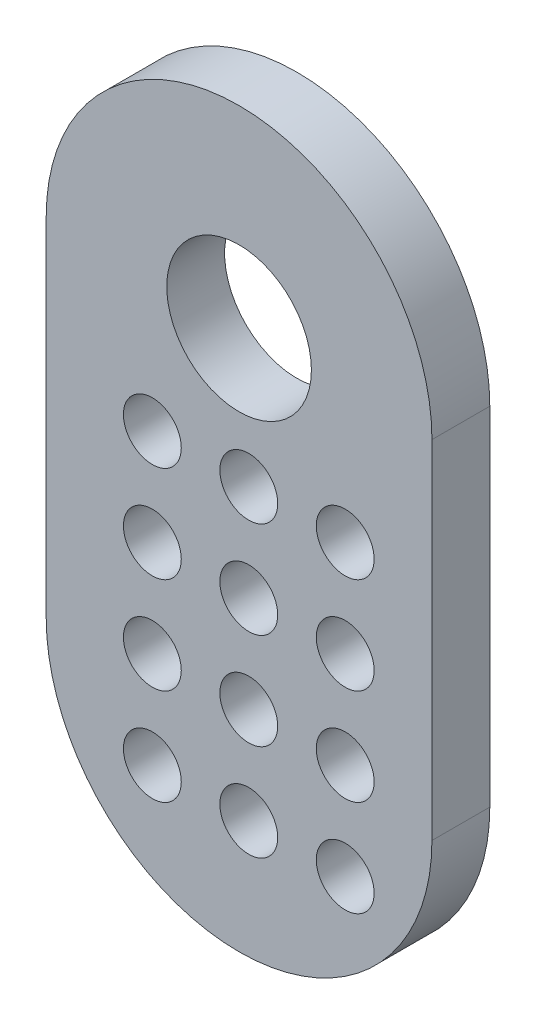
ISO-10303-21;
HEADER;
FILE_DESCRIPTION(('STEP AP214'),'2;1');
FILE_NAME('part.step','',(''),(''),'','','');
FILE_SCHEMA(('AUTOMOTIVE_DESIGN { 1 0 10303 214 1 1 1 1 }'));
ENDSEC;
DATA;
#1=APPLICATION_CONTEXT('core data for automotive mechanical design processes');
#2=APPLICATION_PROTOCOL_DEFINITION('international standard','automotive_design',2000,#1);
#3=PRODUCT_CONTEXT('',#1,'mechanical');
#4=PRODUCT('Part','Part','',(#3));
#5=PRODUCT_RELATED_PRODUCT_CATEGORY('part','',(#4));
#6=PRODUCT_DEFINITION_FORMATION('','',#4);
#7=PRODUCT_DEFINITION_CONTEXT('part definition',#1,'design');
#8=PRODUCT_DEFINITION('design','',#6,#7);
#9=PRODUCT_DEFINITION_SHAPE('','',#8);
#10=(LENGTH_UNIT() NAMED_UNIT(*) SI_UNIT(.MILLI.,.METRE.));
#11=(NAMED_UNIT(*) PLANE_ANGLE_UNIT() SI_UNIT($,.RADIAN.));
#12=(NAMED_UNIT(*) SI_UNIT($,.STERADIAN.) SOLID_ANGLE_UNIT());
#13=UNCERTAINTY_MEASURE_WITH_UNIT(LENGTH_MEASURE(1.E-05),#10,'distance_accuracy_value','');
#14=(GEOMETRIC_REPRESENTATION_CONTEXT(3) GLOBAL_UNCERTAINTY_ASSIGNED_CONTEXT((#13)) GLOBAL_UNIT_ASSIGNED_CONTEXT((#10,
#11,#12)) REPRESENTATION_CONTEXT('',''));
#15=CARTESIAN_POINT('',(0.,0.,0.));
#16=DIRECTION('',(0.,0.,1.));
#17=DIRECTION('',(1.,0.,0.));
#18=AXIS2_PLACEMENT_3D('',#15,#16,#17);
#19=CARTESIAN_POINT('',(-10.,0.,3.));
#20=DIRECTION('',(-1.,0.,0.));
#21=DIRECTION('',(0.,-1.,0.));
#22=AXIS2_PLACEMENT_3D('',#19,#20,#21);
#23=PLANE('',#22);
#24=DIRECTION('',(0.,1.,0.));
#25=VECTOR('',#24,1.);
#26=CARTESIAN_POINT('',(-10.,0.,0.));
#27=LINE('',#26,#25);
#28=CARTESIAN_POINT('',(-10.,-18.,0.));
#29=VERTEX_POINT('',#28);
#30=CARTESIAN_POINT('',(-10.,0.,0.));
#31=VERTEX_POINT('',#30);
#32=EDGE_CURVE('E121',#29,#31,#27,.T.);
#33=ORIENTED_EDGE('',*,*,#32,.F.);
#34=DIRECTION('',(0.,0.,-1.));
#35=VECTOR('',#34,1.);
#36=CARTESIAN_POINT('',(-10.,-18.,3.));
#37=LINE('',#36,#35);
#38=CARTESIAN_POINT('',(-10.,-18.,3.));
#39=VERTEX_POINT('',#38);
#40=EDGE_CURVE('E11',#39,#29,#37,.T.);
#41=ORIENTED_EDGE('',*,*,#40,.F.);
#42=DIRECTION('',(0.,1.,0.));
#43=VECTOR('',#42,1.);
#44=CARTESIAN_POINT('',(-10.,0.,3.));
#45=LINE('',#44,#43);
#46=CARTESIAN_POINT('',(-10.,0.,3.));
#47=VERTEX_POINT('',#46);
#48=EDGE_CURVE('E98',#39,#47,#45,.T.);
#49=ORIENTED_EDGE('',*,*,#48,.T.);
#50=DIRECTION('',(0.,0.,-1.));
#51=VECTOR('',#50,1.);
#52=CARTESIAN_POINT('',(-10.,0.,3.));
#53=LINE('',#52,#51);
#54=EDGE_CURVE('E59',#47,#31,#53,.T.);
#55=ORIENTED_EDGE('',*,*,#54,.T.);
#56=EDGE_LOOP('',(#33,#41,#49,#55));
#57=FACE_BOUND('',#56,.T.);
#58=ADVANCED_FACE('F41',(#57),#23,.T.);
#59=CARTESIAN_POINT('',(0.,-18.,3.));
#60=DIRECTION('',(0.,0.,-1.));
#61=DIRECTION('',(-1.,0.,0.));
#62=AXIS2_PLACEMENT_3D('',#59,#60,#61);
#63=CYLINDRICAL_SURFACE('',#62,10.);
#64=CARTESIAN_POINT('',(0.,-18.,0.));
#65=DIRECTION('',(0.,0.,1.));
#66=DIRECTION('',(1.,0.,0.));
#67=AXIS2_PLACEMENT_3D('',#64,#65,#66);
#68=CIRCLE('',#67,10.);
#69=CARTESIAN_POINT('',(10.,-18.,0.));
#70=VERTEX_POINT('',#69);
#71=EDGE_CURVE('E104',#29,#70,#68,.T.);
#72=ORIENTED_EDGE('',*,*,#71,.T.);
#73=DIRECTION('',(0.,0.,-1.));
#74=VECTOR('',#73,1.);
#75=CARTESIAN_POINT('',(10.,-18.,3.));
#76=LINE('',#75,#74);
#77=CARTESIAN_POINT('',(10.,-18.,3.));
#78=VERTEX_POINT('',#77);
#79=EDGE_CURVE('E51',#78,#70,#76,.T.);
#80=ORIENTED_EDGE('',*,*,#79,.F.);
#81=CARTESIAN_POINT('',(0.,-18.,3.));
#82=DIRECTION('',(0.,0.,1.));
#83=DIRECTION('',(1.,0.,0.));
#84=AXIS2_PLACEMENT_3D('',#81,#82,#83);
#85=CIRCLE('',#84,10.);
#86=EDGE_CURVE('E94',#39,#78,#85,.T.);
#87=ORIENTED_EDGE('',*,*,#86,.F.);
#88=ORIENTED_EDGE('',*,*,#40,.T.);
#89=EDGE_LOOP('',(#72,#80,#87,#88));
#90=FACE_BOUND('',#89,.T.);
#91=ADVANCED_FACE('F102',(#90),#63,.T.);
#92=CARTESIAN_POINT('',(10.,0.,3.));
#93=DIRECTION('',(-1.,0.,0.));
#94=DIRECTION('',(0.,0.,1.));
#95=AXIS2_PLACEMENT_3D('',#92,#93,#94);
#96=PLANE('',#95);
#97=DIRECTION('',(0.,1.,0.));
#98=VECTOR('',#97,1.);
#99=CARTESIAN_POINT('',(10.,0.,0.));
#100=LINE('',#99,#98);
#101=CARTESIAN_POINT('',(10.,0.,0.));
#102=VERTEX_POINT('',#101);
#103=EDGE_CURVE('E116',#70,#102,#100,.T.);
#104=ORIENTED_EDGE('',*,*,#103,.T.);
#105=DIRECTION('',(0.,0.,-1.));
#106=VECTOR('',#105,1.);
#107=CARTESIAN_POINT('',(10.,0.,3.));
#108=LINE('',#107,#106);
#109=CARTESIAN_POINT('',(10.,0.,3.));
#110=VERTEX_POINT('',#109);
#111=EDGE_CURVE('E73',#110,#102,#108,.T.);
#112=ORIENTED_EDGE('',*,*,#111,.F.);
#113=DIRECTION('',(0.,1.,0.));
#114=VECTOR('',#113,1.);
#115=CARTESIAN_POINT('',(10.,0.,3.));
#116=LINE('',#115,#114);
#117=EDGE_CURVE('E85',#78,#110,#116,.T.);
#118=ORIENTED_EDGE('',*,*,#117,.F.);
#119=ORIENTED_EDGE('',*,*,#79,.T.);
#120=EDGE_LOOP('',(#104,#112,#118,#119));
#121=FACE_BOUND('',#120,.T.);
#122=ADVANCED_FACE('F87',(#121),#96,.F.);
#123=CARTESIAN_POINT('',(-4.49661447687407,-6.86721952929556,3.));
#124=DIRECTION('',(0.,0.,-1.));
#125=DIRECTION('',(-1.,0.,0.));
#126=AXIS2_PLACEMENT_3D('',#123,#124,#125);
#127=CYLINDRICAL_SURFACE('',#126,1.5);
#128=CARTESIAN_POINT('',(-4.49661447687407,-6.86721952929556,3.));
#129=DIRECTION('',(0.,0.,1.));
#130=DIRECTION('',(1.,0.,0.));
#131=AXIS2_PLACEMENT_3D('',#128,#129,#130);
#132=CIRCLE('',#131,1.5);
#133=CARTESIAN_POINT('',(-2.99661447687407,-6.86721952929556,3.));
#134=VERTEX_POINT('',#133);
#135=EDGE_CURVE('E180',#134,#134,#132,.T.);
#136=ORIENTED_EDGE('',*,*,#135,.T.);
#137=EDGE_LOOP('',(#136));
#138=FACE_BOUND('',#137,.T.);
#139=CARTESIAN_POINT('',(-4.49661447687407,-6.86721952929556,0.));
#140=DIRECTION('',(0.,0.,1.));
#141=DIRECTION('',(1.,0.,0.));
#142=AXIS2_PLACEMENT_3D('',#139,#140,#141);
#143=CIRCLE('',#142,1.5);
#144=CARTESIAN_POINT('',(-2.99661447687407,-6.86721952929556,0.));
#145=VERTEX_POINT('',#144);
#146=EDGE_CURVE('E124',#145,#145,#143,.T.);
#147=ORIENTED_EDGE('',*,*,#146,.F.);
#148=EDGE_LOOP('',(#147));
#149=FACE_BOUND('',#148,.T.);
#150=ADVANCED_FACE('F263',(#138,#149),#127,.F.);
#151=CARTESIAN_POINT('',(-4.49661447687405,-11.8672195292956,3.));
#152=DIRECTION('',(0.,0.,-1.));
#153=DIRECTION('',(-1.,0.,0.));
#154=AXIS2_PLACEMENT_3D('',#151,#152,#153);
#155=CYLINDRICAL_SURFACE('',#154,1.5);
#156=CARTESIAN_POINT('',(-4.49661447687405,-11.8672195292956,3.));
#157=DIRECTION('',(0.,0.,1.));
#158=DIRECTION('',(1.,0.,0.));
#159=AXIS2_PLACEMENT_3D('',#156,#157,#158);
#160=CIRCLE('',#159,1.5);
#161=CARTESIAN_POINT('',(-2.99661447687405,-11.8672195292956,3.));
#162=VERTEX_POINT('',#161);
#163=EDGE_CURVE('E184',#162,#162,#160,.T.);
#164=ORIENTED_EDGE('',*,*,#163,.T.);
#165=EDGE_LOOP('',(#164));
#166=FACE_BOUND('',#165,.T.);
#167=CARTESIAN_POINT('',(-4.49661447687405,-11.8672195292956,0.));
#168=DIRECTION('',(0.,0.,1.));
#169=DIRECTION('',(1.,0.,0.));
#170=AXIS2_PLACEMENT_3D('',#167,#168,#169);
#171=CIRCLE('',#170,1.5);
#172=CARTESIAN_POINT('',(-2.99661447687405,-11.8672195292956,0.));
#173=VERTEX_POINT('',#172);
#174=EDGE_CURVE('E128',#173,#173,#171,.T.);
#175=ORIENTED_EDGE('',*,*,#174,.F.);
#176=EDGE_LOOP('',(#175));
#177=FACE_BOUND('',#176,.T.);
#178=ADVANCED_FACE('F266',(#166,#177),#155,.F.);
#179=CARTESIAN_POINT('',(-4.49661447687403,-16.8672195292956,3.));
#180=DIRECTION('',(0.,0.,-1.));
#181=DIRECTION('',(-1.,0.,0.));
#182=AXIS2_PLACEMENT_3D('',#179,#180,#181);
#183=CYLINDRICAL_SURFACE('',#182,1.5);
#184=CARTESIAN_POINT('',(-4.49661447687403,-16.8672195292956,3.));
#185=DIRECTION('',(0.,0.,1.));
#186=DIRECTION('',(1.,0.,0.));
#187=AXIS2_PLACEMENT_3D('',#184,#185,#186);
#188=CIRCLE('',#187,1.5);
#189=CARTESIAN_POINT('',(-2.99661447687403,-16.8672195292956,3.));
#190=VERTEX_POINT('',#189);
#191=EDGE_CURVE('E188',#190,#190,#188,.T.);
#192=ORIENTED_EDGE('',*,*,#191,.T.);
#193=EDGE_LOOP('',(#192));
#194=FACE_BOUND('',#193,.T.);
#195=CARTESIAN_POINT('',(-4.49661447687403,-16.8672195292956,0.));
#196=DIRECTION('',(0.,0.,1.));
#197=DIRECTION('',(1.,0.,0.));
#198=AXIS2_PLACEMENT_3D('',#195,#196,#197);
#199=CIRCLE('',#198,1.5);
#200=CARTESIAN_POINT('',(-2.99661447687403,-16.8672195292956,0.));
#201=VERTEX_POINT('',#200);
#202=EDGE_CURVE('E132',#201,#201,#199,.T.);
#203=ORIENTED_EDGE('',*,*,#202,.F.);
#204=EDGE_LOOP('',(#203));
#205=FACE_BOUND('',#204,.T.);
#206=ADVANCED_FACE('F290',(#194,#205),#183,.F.);
#207=CARTESIAN_POINT('',(5.50338552312593,-6.86721952929556,3.));
#208=DIRECTION('',(0.,0.,-1.));
#209=DIRECTION('',(-1.,0.,0.));
#210=AXIS2_PLACEMENT_3D('',#207,#208,#209);
#211=CYLINDRICAL_SURFACE('',#210,1.5);
#212=CARTESIAN_POINT('',(5.50338552312593,-6.86721952929556,3.));
#213=DIRECTION('',(0.,0.,1.));
#214=DIRECTION('',(1.,0.,0.));
#215=AXIS2_PLACEMENT_3D('',#212,#213,#214);
#216=CIRCLE('',#215,1.5);
#217=CARTESIAN_POINT('',(7.00338552312593,-6.86721952929556,3.));
#218=VERTEX_POINT('',#217);
#219=EDGE_CURVE('E192',#218,#218,#216,.T.);
#220=ORIENTED_EDGE('',*,*,#219,.T.);
#221=EDGE_LOOP('',(#220));
#222=FACE_BOUND('',#221,.T.);
#223=CARTESIAN_POINT('',(5.50338552312593,-6.86721952929556,0.));
#224=DIRECTION('',(0.,0.,1.));
#225=DIRECTION('',(1.,0.,0.));
#226=AXIS2_PLACEMENT_3D('',#223,#224,#225);
#227=CIRCLE('',#226,1.5);
#228=CARTESIAN_POINT('',(7.00338552312593,-6.86721952929556,0.));
#229=VERTEX_POINT('',#228);
#230=EDGE_CURVE('E136',#229,#229,#227,.T.);
#231=ORIENTED_EDGE('',*,*,#230,.F.);
#232=EDGE_LOOP('',(#231));
#233=FACE_BOUND('',#232,.T.);
#234=ADVANCED_FACE('F294',(#222,#233),#211,.F.);
#235=CARTESIAN_POINT('',(0.503385523125932,-6.86721952929556,3.));
#236=DIRECTION('',(0.,0.,-1.));
#237=DIRECTION('',(-1.,0.,0.));
#238=AXIS2_PLACEMENT_3D('',#235,#236,#237);
#239=CYLINDRICAL_SURFACE('',#238,1.5);
#240=CARTESIAN_POINT('',(0.503385523125932,-6.86721952929556,3.));
#241=DIRECTION('',(0.,0.,1.));
#242=DIRECTION('',(1.,0.,0.));
#243=AXIS2_PLACEMENT_3D('',#240,#241,#242);
#244=CIRCLE('',#243,1.5);
#245=CARTESIAN_POINT('',(2.00338552312593,-6.86721952929556,3.));
#246=VERTEX_POINT('',#245);
#247=EDGE_CURVE('E196',#246,#246,#244,.T.);
#248=ORIENTED_EDGE('',*,*,#247,.T.);
#249=EDGE_LOOP('',(#248));
#250=FACE_BOUND('',#249,.T.);
#251=CARTESIAN_POINT('',(0.503385523125932,-6.86721952929556,0.));
#252=DIRECTION('',(0.,0.,1.));
#253=DIRECTION('',(1.,0.,0.));
#254=AXIS2_PLACEMENT_3D('',#251,#252,#253);
#255=CIRCLE('',#254,1.5);
#256=CARTESIAN_POINT('',(2.00338552312593,-6.86721952929556,0.));
#257=VERTEX_POINT('',#256);
#258=EDGE_CURVE('E140',#257,#257,#255,.T.);
#259=ORIENTED_EDGE('',*,*,#258,.F.);
#260=EDGE_LOOP('',(#259));
#261=FACE_BOUND('',#260,.T.);
#262=ADVANCED_FACE('F298',(#250,#261),#239,.F.);
#263=CARTESIAN_POINT('',(5.50338552312595,-11.8672195292956,3.));
#264=DIRECTION('',(0.,0.,-1.));
#265=DIRECTION('',(-1.,0.,0.));
#266=AXIS2_PLACEMENT_3D('',#263,#264,#265);
#267=CYLINDRICAL_SURFACE('',#266,1.5);
#268=CARTESIAN_POINT('',(5.50338552312595,-11.8672195292956,3.));
#269=DIRECTION('',(0.,0.,1.));
#270=DIRECTION('',(1.,0.,0.));
#271=AXIS2_PLACEMENT_3D('',#268,#269,#270);
#272=CIRCLE('',#271,1.5);
#273=CARTESIAN_POINT('',(7.00338552312595,-11.8672195292956,3.));
#274=VERTEX_POINT('',#273);
#275=EDGE_CURVE('E200',#274,#274,#272,.T.);
#276=ORIENTED_EDGE('',*,*,#275,.T.);
#277=EDGE_LOOP('',(#276));
#278=FACE_BOUND('',#277,.T.);
#279=CARTESIAN_POINT('',(5.50338552312595,-11.8672195292956,0.));
#280=DIRECTION('',(0.,0.,1.));
#281=DIRECTION('',(1.,0.,0.));
#282=AXIS2_PLACEMENT_3D('',#279,#280,#281);
#283=CIRCLE('',#282,1.5);
#284=CARTESIAN_POINT('',(7.00338552312595,-11.8672195292956,0.));
#285=VERTEX_POINT('',#284);
#286=EDGE_CURVE('E144',#285,#285,#283,.T.);
#287=ORIENTED_EDGE('',*,*,#286,.F.);
#288=EDGE_LOOP('',(#287));
#289=FACE_BOUND('',#288,.T.);
#290=ADVANCED_FACE('F302',(#278,#289),#267,.F.);
#291=CARTESIAN_POINT('',(0.503385523125949,-11.8672195292956,3.));
#292=DIRECTION('',(0.,0.,-1.));
#293=DIRECTION('',(-1.,0.,0.));
#294=AXIS2_PLACEMENT_3D('',#291,#292,#293);
#295=CYLINDRICAL_SURFACE('',#294,1.5);
#296=CARTESIAN_POINT('',(0.503385523125949,-11.8672195292956,3.));
#297=DIRECTION('',(0.,0.,1.));
#298=DIRECTION('',(1.,0.,0.));
#299=AXIS2_PLACEMENT_3D('',#296,#297,#298);
#300=CIRCLE('',#299,1.5);
#301=CARTESIAN_POINT('',(2.00338552312595,-11.8672195292956,3.));
#302=VERTEX_POINT('',#301);
#303=EDGE_CURVE('E204',#302,#302,#300,.T.);
#304=ORIENTED_EDGE('',*,*,#303,.T.);
#305=EDGE_LOOP('',(#304));
#306=FACE_BOUND('',#305,.T.);
#307=CARTESIAN_POINT('',(0.503385523125949,-11.8672195292956,0.));
#308=DIRECTION('',(0.,0.,1.));
#309=DIRECTION('',(1.,0.,0.));
#310=AXIS2_PLACEMENT_3D('',#307,#308,#309);
#311=CIRCLE('',#310,1.5);
#312=CARTESIAN_POINT('',(2.00338552312595,-11.8672195292956,0.));
#313=VERTEX_POINT('',#312);
#314=EDGE_CURVE('E148',#313,#313,#311,.T.);
#315=ORIENTED_EDGE('',*,*,#314,.F.);
#316=EDGE_LOOP('',(#315));
#317=FACE_BOUND('',#316,.T.);
#318=ADVANCED_FACE('F306',(#306,#317),#295,.F.);
#319=CARTESIAN_POINT('',(5.50338552312597,-16.8672195292956,3.));
#320=DIRECTION('',(0.,0.,-1.));
#321=DIRECTION('',(-1.,0.,0.));
#322=AXIS2_PLACEMENT_3D('',#319,#320,#321);
#323=CYLINDRICAL_SURFACE('',#322,1.5);
#324=CARTESIAN_POINT('',(5.50338552312597,-16.8672195292956,3.));
#325=DIRECTION('',(0.,0.,1.));
#326=DIRECTION('',(1.,0.,0.));
#327=AXIS2_PLACEMENT_3D('',#324,#325,#326);
#328=CIRCLE('',#327,1.5);
#329=CARTESIAN_POINT('',(7.00338552312597,-16.8672195292956,3.));
#330=VERTEX_POINT('',#329);
#331=EDGE_CURVE('E208',#330,#330,#328,.T.);
#332=ORIENTED_EDGE('',*,*,#331,.T.);
#333=EDGE_LOOP('',(#332));
#334=FACE_BOUND('',#333,.T.);
#335=CARTESIAN_POINT('',(5.50338552312597,-16.8672195292956,0.));
#336=DIRECTION('',(0.,0.,1.));
#337=DIRECTION('',(1.,0.,0.));
#338=AXIS2_PLACEMENT_3D('',#335,#336,#337);
#339=CIRCLE('',#338,1.5);
#340=CARTESIAN_POINT('',(7.00338552312597,-16.8672195292956,0.));
#341=VERTEX_POINT('',#340);
#342=EDGE_CURVE('E152',#341,#341,#339,.T.);
#343=ORIENTED_EDGE('',*,*,#342,.F.);
#344=EDGE_LOOP('',(#343));
#345=FACE_BOUND('',#344,.T.);
#346=ADVANCED_FACE('F310',(#334,#345),#323,.F.);
#347=CARTESIAN_POINT('',(0.503385523125966,-16.8672195292956,3.));
#348=DIRECTION('',(0.,0.,-1.));
#349=DIRECTION('',(-1.,0.,0.));
#350=AXIS2_PLACEMENT_3D('',#347,#348,#349);
#351=CYLINDRICAL_SURFACE('',#350,1.5);
#352=CARTESIAN_POINT('',(0.503385523125966,-16.8672195292956,3.));
#353=DIRECTION('',(0.,0.,1.));
#354=DIRECTION('',(1.,0.,0.));
#355=AXIS2_PLACEMENT_3D('',#352,#353,#354);
#356=CIRCLE('',#355,1.5);
#357=CARTESIAN_POINT('',(2.00338552312597,-16.8672195292956,3.));
#358=VERTEX_POINT('',#357);
#359=EDGE_CURVE('E212',#358,#358,#356,.T.);
#360=ORIENTED_EDGE('',*,*,#359,.T.);
#361=EDGE_LOOP('',(#360));
#362=FACE_BOUND('',#361,.T.);
#363=CARTESIAN_POINT('',(0.503385523125966,-16.8672195292956,0.));
#364=DIRECTION('',(0.,0.,1.));
#365=DIRECTION('',(1.,0.,0.));
#366=AXIS2_PLACEMENT_3D('',#363,#364,#365);
#367=CIRCLE('',#366,1.5);
#368=CARTESIAN_POINT('',(2.00338552312597,-16.8672195292956,0.));
#369=VERTEX_POINT('',#368);
#370=EDGE_CURVE('E156',#369,#369,#367,.T.);
#371=ORIENTED_EDGE('',*,*,#370,.F.);
#372=EDGE_LOOP('',(#371));
#373=FACE_BOUND('',#372,.T.);
#374=ADVANCED_FACE('F314',(#362,#373),#351,.F.);
#375=CARTESIAN_POINT('',(5.50338552312598,-21.8672195292956,3.));
#376=DIRECTION('',(0.,0.,-1.));
#377=DIRECTION('',(-1.,0.,0.));
#378=AXIS2_PLACEMENT_3D('',#375,#376,#377);
#379=CYLINDRICAL_SURFACE('',#378,1.5);
#380=CARTESIAN_POINT('',(5.50338552312598,-21.8672195292956,3.));
#381=DIRECTION('',(0.,0.,1.));
#382=DIRECTION('',(1.,0.,0.));
#383=AXIS2_PLACEMENT_3D('',#380,#381,#382);
#384=CIRCLE('',#383,1.5);
#385=CARTESIAN_POINT('',(7.00338552312598,-21.8672195292956,3.));
#386=VERTEX_POINT('',#385);
#387=EDGE_CURVE('E216',#386,#386,#384,.T.);
#388=ORIENTED_EDGE('',*,*,#387,.T.);
#389=EDGE_LOOP('',(#388));
#390=FACE_BOUND('',#389,.T.);
#391=CARTESIAN_POINT('',(5.50338552312598,-21.8672195292956,0.));
#392=DIRECTION('',(0.,0.,1.));
#393=DIRECTION('',(1.,0.,0.));
#394=AXIS2_PLACEMENT_3D('',#391,#392,#393);
#395=CIRCLE('',#394,1.5);
#396=CARTESIAN_POINT('',(7.00338552312598,-21.8672195292956,0.));
#397=VERTEX_POINT('',#396);
#398=EDGE_CURVE('E160',#397,#397,#395,.T.);
#399=ORIENTED_EDGE('',*,*,#398,.F.);
#400=EDGE_LOOP('',(#399));
#401=FACE_BOUND('',#400,.T.);
#402=ADVANCED_FACE('F318',(#390,#401),#379,.F.);
#403=CARTESIAN_POINT('',(0.503385523125984,-21.8672195292956,3.));
#404=DIRECTION('',(0.,0.,-1.));
#405=DIRECTION('',(-1.,0.,0.));
#406=AXIS2_PLACEMENT_3D('',#403,#404,#405);
#407=CYLINDRICAL_SURFACE('',#406,1.5);
#408=CARTESIAN_POINT('',(0.503385523125984,-21.8672195292956,3.));
#409=DIRECTION('',(0.,0.,1.));
#410=DIRECTION('',(1.,0.,0.));
#411=AXIS2_PLACEMENT_3D('',#408,#409,#410);
#412=CIRCLE('',#411,1.5);
#413=CARTESIAN_POINT('',(2.00338552312598,-21.8672195292956,3.));
#414=VERTEX_POINT('',#413);
#415=EDGE_CURVE('E220',#414,#414,#412,.T.);
#416=ORIENTED_EDGE('',*,*,#415,.T.);
#417=EDGE_LOOP('',(#416));
#418=FACE_BOUND('',#417,.T.);
#419=CARTESIAN_POINT('',(0.503385523125984,-21.8672195292956,0.));
#420=DIRECTION('',(0.,0.,1.));
#421=DIRECTION('',(1.,0.,0.));
#422=AXIS2_PLACEMENT_3D('',#419,#420,#421);
#423=CIRCLE('',#422,1.5);
#424=CARTESIAN_POINT('',(2.00338552312598,-21.8672195292956,0.));
#425=VERTEX_POINT('',#424);
#426=EDGE_CURVE('E164',#425,#425,#423,.T.);
#427=ORIENTED_EDGE('',*,*,#426,.F.);
#428=EDGE_LOOP('',(#427));
#429=FACE_BOUND('',#428,.T.);
#430=ADVANCED_FACE('F322',(#418,#429),#407,.F.);
#431=CARTESIAN_POINT('',(-4.49661447687402,-21.8672195292956,3.));
#432=DIRECTION('',(0.,0.,-1.));
#433=DIRECTION('',(-1.,0.,0.));
#434=AXIS2_PLACEMENT_3D('',#431,#432,#433);
#435=CYLINDRICAL_SURFACE('',#434,1.5);
#436=CARTESIAN_POINT('',(-4.49661447687402,-21.8672195292956,3.));
#437=DIRECTION('',(0.,0.,1.));
#438=DIRECTION('',(1.,0.,0.));
#439=AXIS2_PLACEMENT_3D('',#436,#437,#438);
#440=CIRCLE('',#439,1.5);
#441=CARTESIAN_POINT('',(-2.99661447687402,-21.8672195292956,3.));
#442=VERTEX_POINT('',#441);
#443=EDGE_CURVE('E224',#442,#442,#440,.T.);
#444=ORIENTED_EDGE('',*,*,#443,.T.);
#445=EDGE_LOOP('',(#444));
#446=FACE_BOUND('',#445,.T.);
#447=CARTESIAN_POINT('',(-4.49661447687402,-21.8672195292956,0.));
#448=DIRECTION('',(0.,0.,1.));
#449=DIRECTION('',(1.,0.,0.));
#450=AXIS2_PLACEMENT_3D('',#447,#448,#449);
#451=CIRCLE('',#450,1.5);
#452=CARTESIAN_POINT('',(-2.99661447687402,-21.8672195292956,0.));
#453=VERTEX_POINT('',#452);
#454=EDGE_CURVE('E168',#453,#453,#451,.T.);
#455=ORIENTED_EDGE('',*,*,#454,.F.);
#456=EDGE_LOOP('',(#455));
#457=FACE_BOUND('',#456,.T.);
#458=ADVANCED_FACE('F279',(#446,#457),#435,.F.);
#459=CARTESIAN_POINT('',(0.,0.,3.));
#460=DIRECTION('',(0.,0.,-1.));
#461=DIRECTION('',(-1.,0.,0.));
#462=AXIS2_PLACEMENT_3D('',#459,#460,#461);
#463=CYLINDRICAL_SURFACE('',#462,3.75);
#464=CARTESIAN_POINT('',(0.,0.,3.));
#465=DIRECTION('',(0.,0.,1.));
#466=DIRECTION('',(1.,0.,0.));
#467=AXIS2_PLACEMENT_3D('',#464,#465,#466);
#468=CIRCLE('',#467,3.75);
#469=CARTESIAN_POINT('',(3.75,0.,3.));
#470=VERTEX_POINT('',#469);
#471=EDGE_CURVE('E115',#470,#470,#468,.T.);
#472=ORIENTED_EDGE('',*,*,#471,.T.);
#473=EDGE_LOOP('',(#472));
#474=FACE_BOUND('',#473,.T.);
#475=CARTESIAN_POINT('',(0.,0.,0.));
#476=DIRECTION('',(0.,0.,1.));
#477=DIRECTION('',(1.,0.,0.));
#478=AXIS2_PLACEMENT_3D('',#475,#476,#477);
#479=CIRCLE('',#478,3.75);
#480=CARTESIAN_POINT('',(3.75,0.,0.));
#481=VERTEX_POINT('',#480);
#482=EDGE_CURVE('E172',#481,#481,#479,.T.);
#483=ORIENTED_EDGE('',*,*,#482,.F.);
#484=EDGE_LOOP('',(#483));
#485=FACE_BOUND('',#484,.T.);
#486=ADVANCED_FACE('F43',(#474,#485),#463,.F.);
#487=CARTESIAN_POINT('',(0.,0.,3.));
#488=DIRECTION('',(0.,0.,-1.));
#489=DIRECTION('',(-1.,0.,0.));
#490=AXIS2_PLACEMENT_3D('',#487,#488,#489);
#491=CYLINDRICAL_SURFACE('',#490,10.);
#492=CARTESIAN_POINT('',(0.,0.,0.));
#493=DIRECTION('',(0.,0.,1.));
#494=DIRECTION('',(1.,0.,0.));
#495=AXIS2_PLACEMENT_3D('',#492,#493,#494);
#496=CIRCLE('',#495,10.);
#497=EDGE_CURVE('E111',#31,#102,#496,.F.);
#498=ORIENTED_EDGE('',*,*,#497,.F.);
#499=ORIENTED_EDGE('',*,*,#54,.F.);
#500=CARTESIAN_POINT('',(0.,0.,3.));
#501=DIRECTION('',(0.,0.,1.));
#502=DIRECTION('',(1.,0.,0.));
#503=AXIS2_PLACEMENT_3D('',#500,#501,#502);
#504=CIRCLE('',#503,10.);
#505=EDGE_CURVE('E93',#47,#110,#504,.F.);
#506=ORIENTED_EDGE('',*,*,#505,.T.);
#507=ORIENTED_EDGE('',*,*,#111,.T.);
#508=EDGE_LOOP('',(#498,#499,#506,#507));
#509=FACE_BOUND('',#508,.T.);
#510=ADVANCED_FACE('F237',(#509),#491,.T.);
#511=CARTESIAN_POINT('',(0.,0.,3.));
#512=DIRECTION('',(0.,0.,1.));
#513=DIRECTION('',(1.,0.,0.));
#514=AXIS2_PLACEMENT_3D('',#511,#512,#513);
#515=PLANE('',#514);
#516=ORIENTED_EDGE('',*,*,#471,.F.);
#517=EDGE_LOOP('',(#516));
#518=FACE_BOUND('',#517,.T.);
#519=ORIENTED_EDGE('',*,*,#443,.F.);
#520=EDGE_LOOP('',(#519));
#521=FACE_BOUND('',#520,.T.);
#522=ORIENTED_EDGE('',*,*,#415,.F.);
#523=EDGE_LOOP('',(#522));
#524=FACE_BOUND('',#523,.T.);
#525=ORIENTED_EDGE('',*,*,#387,.F.);
#526=EDGE_LOOP('',(#525));
#527=FACE_BOUND('',#526,.T.);
#528=ORIENTED_EDGE('',*,*,#359,.F.);
#529=EDGE_LOOP('',(#528));
#530=FACE_BOUND('',#529,.T.);
#531=ORIENTED_EDGE('',*,*,#331,.F.);
#532=EDGE_LOOP('',(#531));
#533=FACE_BOUND('',#532,.T.);
#534=ORIENTED_EDGE('',*,*,#303,.F.);
#535=EDGE_LOOP('',(#534));
#536=FACE_BOUND('',#535,.T.);
#537=ORIENTED_EDGE('',*,*,#275,.F.);
#538=EDGE_LOOP('',(#537));
#539=FACE_BOUND('',#538,.T.);
#540=ORIENTED_EDGE('',*,*,#247,.F.);
#541=EDGE_LOOP('',(#540));
#542=FACE_BOUND('',#541,.T.);
#543=ORIENTED_EDGE('',*,*,#219,.F.);
#544=EDGE_LOOP('',(#543));
#545=FACE_BOUND('',#544,.T.);
#546=ORIENTED_EDGE('',*,*,#191,.F.);
#547=EDGE_LOOP('',(#546));
#548=FACE_BOUND('',#547,.T.);
#549=ORIENTED_EDGE('',*,*,#163,.F.);
#550=EDGE_LOOP('',(#549));
#551=FACE_BOUND('',#550,.T.);
#552=ORIENTED_EDGE('',*,*,#135,.F.);
#553=EDGE_LOOP('',(#552));
#554=FACE_BOUND('',#553,.T.);
#555=ORIENTED_EDGE('',*,*,#48,.F.);
#556=ORIENTED_EDGE('',*,*,#86,.T.);
#557=ORIENTED_EDGE('',*,*,#117,.T.);
#558=ORIENTED_EDGE('',*,*,#505,.F.);
#559=EDGE_LOOP('',(#555,#556,#557,#558));
#560=FACE_BOUND('',#559,.T.);
#561=ADVANCED_FACE('F97',(#518,#521,#524,#527,#530,#533,#536,#539,#542,#545,#548,#551,#554,
#560),#515,.T.);
#562=CARTESIAN_POINT('',(0.,0.,0.));
#563=DIRECTION('',(0.,0.,1.));
#564=DIRECTION('',(1.,0.,0.));
#565=AXIS2_PLACEMENT_3D('',#562,#563,#564);
#566=PLANE('',#565);
#567=ORIENTED_EDGE('',*,*,#482,.T.);
#568=EDGE_LOOP('',(#567));
#569=FACE_BOUND('',#568,.T.);
#570=ORIENTED_EDGE('',*,*,#454,.T.);
#571=EDGE_LOOP('',(#570));
#572=FACE_BOUND('',#571,.T.);
#573=ORIENTED_EDGE('',*,*,#426,.T.);
#574=EDGE_LOOP('',(#573));
#575=FACE_BOUND('',#574,.T.);
#576=ORIENTED_EDGE('',*,*,#398,.T.);
#577=EDGE_LOOP('',(#576));
#578=FACE_BOUND('',#577,.T.);
#579=ORIENTED_EDGE('',*,*,#370,.T.);
#580=EDGE_LOOP('',(#579));
#581=FACE_BOUND('',#580,.T.);
#582=ORIENTED_EDGE('',*,*,#342,.T.);
#583=EDGE_LOOP('',(#582));
#584=FACE_BOUND('',#583,.T.);
#585=ORIENTED_EDGE('',*,*,#314,.T.);
#586=EDGE_LOOP('',(#585));
#587=FACE_BOUND('',#586,.T.);
#588=ORIENTED_EDGE('',*,*,#286,.T.);
#589=EDGE_LOOP('',(#588));
#590=FACE_BOUND('',#589,.T.);
#591=ORIENTED_EDGE('',*,*,#258,.T.);
#592=EDGE_LOOP('',(#591));
#593=FACE_BOUND('',#592,.T.);
#594=ORIENTED_EDGE('',*,*,#230,.T.);
#595=EDGE_LOOP('',(#594));
#596=FACE_BOUND('',#595,.T.);
#597=ORIENTED_EDGE('',*,*,#202,.T.);
#598=EDGE_LOOP('',(#597));
#599=FACE_BOUND('',#598,.T.);
#600=ORIENTED_EDGE('',*,*,#174,.T.);
#601=EDGE_LOOP('',(#600));
#602=FACE_BOUND('',#601,.T.);
#603=ORIENTED_EDGE('',*,*,#146,.T.);
#604=EDGE_LOOP('',(#603));
#605=FACE_BOUND('',#604,.T.);
#606=ORIENTED_EDGE('',*,*,#32,.T.);
#607=ORIENTED_EDGE('',*,*,#497,.T.);
#608=ORIENTED_EDGE('',*,*,#103,.F.);
#609=ORIENTED_EDGE('',*,*,#71,.F.);
#610=EDGE_LOOP('',(#606,#607,#608,#609));
#611=FACE_BOUND('',#610,.T.);
#612=ADVANCED_FACE('F236',(#569,#572,#575,#578,#581,#584,#587,#590,#593,#596,#599,#602,#605,
#611),#566,.F.);
#613=CLOSED_SHELL('',(#58,#91,#122,#150,#178,#206,#234,#262,#290,#318,#346,#374,#402,#430,#458,
#486,#510,#561,#612));
#614=MANIFOLD_SOLID_BREP('B2',#613);
#615=ADVANCED_BREP_SHAPE_REPRESENTATION('',(#18,#614),#14);
#616=SHAPE_DEFINITION_REPRESENTATION(#9,#615);
ENDSEC;
END-ISO-10303-21;
